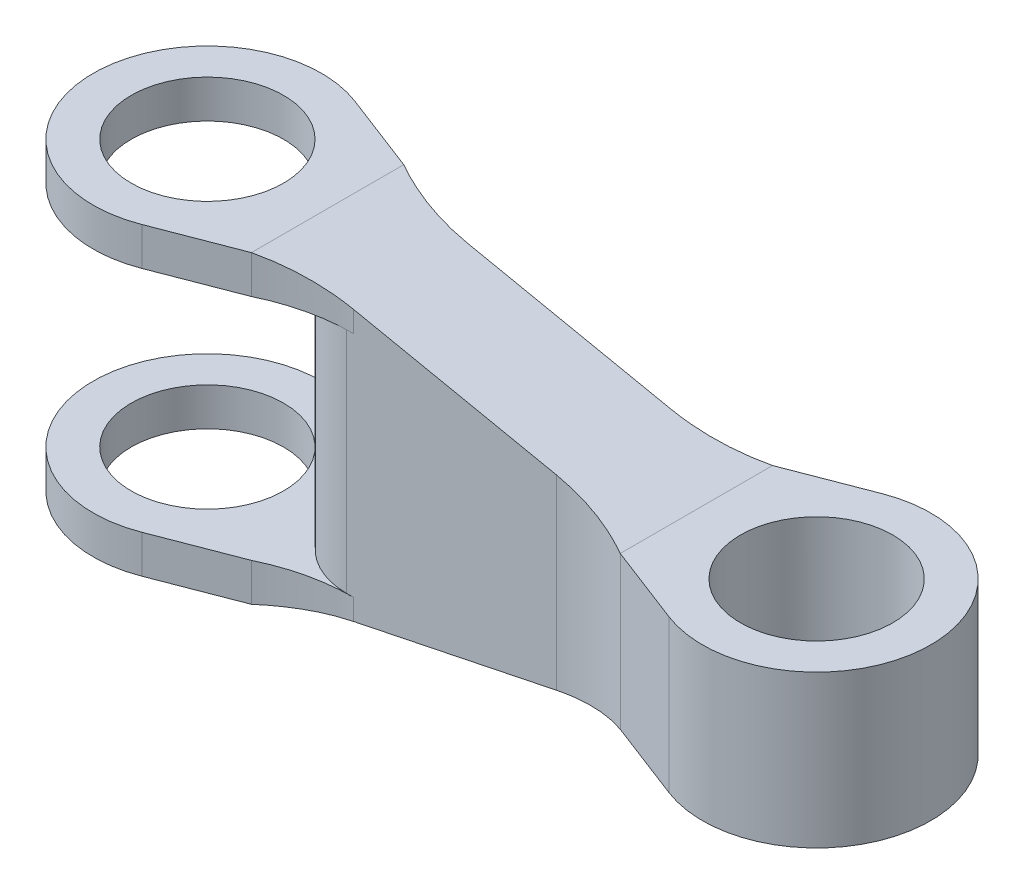
ISO-10303-21;
HEADER;
FILE_DESCRIPTION(('STEP AP214'),'2;1');
FILE_NAME('part.step','',(''),(''),'','','');
FILE_SCHEMA(('AUTOMOTIVE_DESIGN { 1 0 10303 214 1 1 1 1 }'));
ENDSEC;
DATA;
#1=APPLICATION_CONTEXT('core data for automotive mechanical design processes');
#2=APPLICATION_PROTOCOL_DEFINITION('international standard','automotive_design',2000,#1);
#3=PRODUCT_CONTEXT('',#1,'mechanical');
#4=PRODUCT('Part','Part','',(#3));
#5=PRODUCT_RELATED_PRODUCT_CATEGORY('part','',(#4));
#6=PRODUCT_DEFINITION_FORMATION('','',#4);
#7=PRODUCT_DEFINITION_CONTEXT('part definition',#1,'design');
#8=PRODUCT_DEFINITION('design','',#6,#7);
#9=PRODUCT_DEFINITION_SHAPE('','',#8);
#10=(LENGTH_UNIT() NAMED_UNIT(*) SI_UNIT(.MILLI.,.METRE.));
#11=(NAMED_UNIT(*) PLANE_ANGLE_UNIT() SI_UNIT($,.RADIAN.));
#12=(NAMED_UNIT(*) SI_UNIT($,.STERADIAN.) SOLID_ANGLE_UNIT());
#13=UNCERTAINTY_MEASURE_WITH_UNIT(LENGTH_MEASURE(1.E-05),#10,'distance_accuracy_value','');
#14=(GEOMETRIC_REPRESENTATION_CONTEXT(3) GLOBAL_UNCERTAINTY_ASSIGNED_CONTEXT((#13)) GLOBAL_UNIT_ASSIGNED_CONTEXT((#10,
#11,#12)) REPRESENTATION_CONTEXT('',''));
#15=CARTESIAN_POINT('',(0.,0.,0.));
#16=DIRECTION('',(0.,0.,1.));
#17=DIRECTION('',(1.,0.,0.));
#18=AXIS2_PLACEMENT_3D('',#15,#16,#17);
#19=CARTESIAN_POINT('',(0.,10.16,0.));
#20=DIRECTION('',(0.,-1.,0.));
#21=DIRECTION('',(0.,0.,-1.));
#22=AXIS2_PLACEMENT_3D('',#19,#20,#21);
#23=CYLINDRICAL_SURFACE('',#22,7.62);
#24=CARTESIAN_POINT('',(0.,-7.62,0.));
#25=DIRECTION('',(0.,-1.,0.));
#26=DIRECTION('',(0.,0.,-1.));
#27=AXIS2_PLACEMENT_3D('',#24,#25,#26);
#28=CIRCLE('',#27,7.62);
#29=CARTESIAN_POINT('',(2.73566372202433,-7.62,7.112));
#30=VERTEX_POINT('',#29);
#31=CARTESIAN_POINT('',(2.73566372202433,-7.62,-7.112));
#32=VERTEX_POINT('',#31);
#33=EDGE_CURVE('E327',#30,#32,#28,.T.);
#34=ORIENTED_EDGE('',*,*,#33,.T.);
#35=DIRECTION('',(0.,-1.,0.));
#36=VECTOR('',#35,1.);
#37=CARTESIAN_POINT('',(2.73566372202433,10.16,-7.112));
#38=LINE('',#37,#36);
#39=CARTESIAN_POINT('',(2.73566372202433,-10.16,-7.112));
#40=VERTEX_POINT('',#39);
#41=EDGE_CURVE('E370',#32,#40,#38,.T.);
#42=ORIENTED_EDGE('',*,*,#41,.T.);
#43=CARTESIAN_POINT('',(0.,-10.16,0.));
#44=DIRECTION('',(0.,1.,0.));
#45=DIRECTION('',(0.,0.,1.));
#46=AXIS2_PLACEMENT_3D('',#43,#44,#45);
#47=CIRCLE('',#46,7.62);
#48=CARTESIAN_POINT('',(2.73566372202433,-10.16,7.112));
#49=VERTEX_POINT('',#48);
#50=EDGE_CURVE('E358',#40,#49,#47,.T.);
#51=ORIENTED_EDGE('',*,*,#50,.T.);
#52=DIRECTION('',(0.,-1.,0.));
#53=VECTOR('',#52,1.);
#54=CARTESIAN_POINT('',(2.73566372202433,10.16,7.112));
#55=LINE('',#54,#53);
#56=EDGE_CURVE('E219',#30,#49,#55,.T.);
#57=ORIENTED_EDGE('',*,*,#56,.F.);
#58=EDGE_LOOP('',(#34,#42,#51,#57));
#59=FACE_BOUND('',#58,.T.);
#60=ADVANCED_FACE('F35',(#59),#23,.T.);
#61=CARTESIAN_POINT('',(2.73566372202433,10.16,7.112));
#62=DIRECTION('',(-0.359010987142301,0.,-0.933333333333333));
#63=DIRECTION('',(-0.933333333333333,0.,0.359010987142301));
#64=AXIS2_PLACEMENT_3D('',#61,#62,#63);
#65=PLANE('',#64);
#66=CARTESIAN_POINT('',(2.73566372202433,10.16,7.112));
#67=VERTEX_POINT('',#66);
#68=CARTESIAN_POINT('',(2.73566372202433,7.62,7.112));
#69=VERTEX_POINT('',#68);
#70=EDGE_CURVE('E220',#67,#69,#55,.T.);
#71=ORIENTED_EDGE('',*,*,#70,.T.);
#72=DIRECTION('',(0.933333333333333,0.,-0.359010987142301));
#73=VECTOR('',#72,1.);
#74=CARTESIAN_POINT('',(2.73566372202433,7.62,7.112));
#75=LINE('',#74,#73);
#76=CARTESIAN_POINT('',(8.01832470248509,7.62,5.08));
#77=VERTEX_POINT('',#76);
#78=EDGE_CURVE('E336',#69,#77,#75,.T.);
#79=ORIENTED_EDGE('',*,*,#78,.T.);
#80=DIRECTION('',(0.,-1.,0.));
#81=VECTOR('',#80,1.);
#82=CARTESIAN_POINT('',(8.01832470248509,10.16,5.08));
#83=LINE('',#82,#81);
#84=CARTESIAN_POINT('',(8.01832470248509,10.16,5.08));
#85=VERTEX_POINT('',#84);
#86=EDGE_CURVE('E216',#85,#77,#83,.T.);
#87=ORIENTED_EDGE('',*,*,#86,.F.);
#88=DIRECTION('',(0.933333333333333,0.,-0.359010987142301));
#89=VECTOR('',#88,1.);
#90=CARTESIAN_POINT('',(2.73566372202433,10.16,7.112));
#91=LINE('',#90,#89);
#92=EDGE_CURVE('E364',#67,#85,#91,.T.);
#93=ORIENTED_EDGE('',*,*,#92,.F.);
#94=EDGE_LOOP('',(#71,#79,#87,#93));
#95=FACE_BOUND('',#94,.T.);
#96=ADVANCED_FACE('F439',(#95),#65,.F.);
#97=CARTESIAN_POINT('',(2.73566372202433,10.16,-7.112));
#98=DIRECTION('',(-0.359010987142301,0.,0.933333333333333));
#99=DIRECTION('',(0.933333333333333,0.,0.359010987142301));
#100=AXIS2_PLACEMENT_3D('',#97,#98,#99);
#101=PLANE('',#100);
#102=DIRECTION('',(0.,-1.,0.));
#103=VECTOR('',#102,1.);
#104=CARTESIAN_POINT('',(8.01832470248509,10.16,-5.08));
#105=LINE('',#104,#103);
#106=CARTESIAN_POINT('',(8.01832470248509,10.16,-5.08));
#107=VERTEX_POINT('',#106);
#108=CARTESIAN_POINT('',(8.01832470248509,7.62,-5.08));
#109=VERTEX_POINT('',#108);
#110=EDGE_CURVE('E209',#107,#109,#105,.T.);
#111=ORIENTED_EDGE('',*,*,#110,.T.);
#112=DIRECTION('',(-0.933333333333333,0.,-0.359010987142301));
#113=VECTOR('',#112,1.);
#114=CARTESIAN_POINT('',(2.73566372202433,7.62,-7.112));
#115=LINE('',#114,#113);
#116=CARTESIAN_POINT('',(2.73566372202433,7.62,-7.112));
#117=VERTEX_POINT('',#116);
#118=EDGE_CURVE('E236',#109,#117,#115,.T.);
#119=ORIENTED_EDGE('',*,*,#118,.T.);
#120=CARTESIAN_POINT('',(2.73566372202433,10.16,-7.112));
#121=VERTEX_POINT('',#120);
#122=EDGE_CURVE('E378',#121,#117,#38,.T.);
#123=ORIENTED_EDGE('',*,*,#122,.F.);
#124=DIRECTION('',(-0.933333333333333,0.,-0.359010987142301));
#125=VECTOR('',#124,1.);
#126=CARTESIAN_POINT('',(2.73566372202433,10.16,-7.112));
#127=LINE('',#126,#125);
#128=EDGE_CURVE('E368',#107,#121,#127,.T.);
#129=ORIENTED_EDGE('',*,*,#128,.F.);
#130=EDGE_LOOP('',(#111,#119,#123,#129));
#131=FACE_BOUND('',#130,.T.);
#132=ADVANCED_FACE('F451',(#131),#101,.F.);
#133=CARTESIAN_POINT('',(0.,10.16,0.));
#134=DIRECTION('',(0.,-1.,0.));
#135=DIRECTION('',(0.,0.,-1.));
#136=AXIS2_PLACEMENT_3D('',#133,#134,#135);
#137=CYLINDRICAL_SURFACE('',#136,5.08);
#138=CARTESIAN_POINT('',(0.,7.62,0.));
#139=DIRECTION('',(0.,1.,0.));
#140=DIRECTION('',(0.,0.,1.));
#141=AXIS2_PLACEMENT_3D('',#138,#139,#140);
#142=CIRCLE('',#141,5.08);
#143=CARTESIAN_POINT('',(0.,7.62,5.08));
#144=VERTEX_POINT('',#143);
#145=EDGE_CURVE('E233',#144,#144,#142,.T.);
#146=ORIENTED_EDGE('',*,*,#145,.F.);
#147=EDGE_LOOP('',(#146));
#148=FACE_BOUND('',#147,.T.);
#149=CARTESIAN_POINT('',(0.,10.16,0.));
#150=DIRECTION('',(0.,1.,0.));
#151=DIRECTION('',(0.,0.,1.));
#152=AXIS2_PLACEMENT_3D('',#149,#150,#151);
#153=CIRCLE('',#152,5.08);
#154=CARTESIAN_POINT('',(0.,10.16,5.08));
#155=VERTEX_POINT('',#154);
#156=EDGE_CURVE('E355',#155,#155,#153,.T.);
#157=ORIENTED_EDGE('',*,*,#156,.T.);
#158=EDGE_LOOP('',(#157));
#159=FACE_BOUND('',#158,.T.);
#160=ADVANCED_FACE('F453',(#148,#159),#137,.F.);
#161=CARTESIAN_POINT('',(0.,10.16,0.));
#162=DIRECTION('',(0.,1.,0.));
#163=DIRECTION('',(0.,0.,1.));
#164=AXIS2_PLACEMENT_3D('',#161,#162,#163);
#165=PLANE('',#164);
#166=DIRECTION('',(0.,0.,1.));
#167=VECTOR('',#166,1.);
#168=CARTESIAN_POINT('',(8.01832470248509,10.16,-7.62));
#169=LINE('',#168,#167);
#170=EDGE_CURVE('E339',#107,#85,#169,.T.);
#171=ORIENTED_EDGE('',*,*,#170,.F.);
#172=ORIENTED_EDGE('',*,*,#128,.T.);
#173=CARTESIAN_POINT('',(0.,10.16,0.));
#174=DIRECTION('',(0.,1.,0.));
#175=DIRECTION('',(0.,0.,1.));
#176=AXIS2_PLACEMENT_3D('',#173,#174,#175);
#177=CIRCLE('',#176,7.62);
#178=EDGE_CURVE('E361',#121,#67,#177,.T.);
#179=ORIENTED_EDGE('',*,*,#178,.T.);
#180=ORIENTED_EDGE('',*,*,#92,.T.);
#181=EDGE_LOOP('',(#171,#172,#179,#180));
#182=FACE_BOUND('',#181,.T.);
#183=ORIENTED_EDGE('',*,*,#156,.F.);
#184=EDGE_LOOP('',(#183));
#185=FACE_BOUND('',#184,.T.);
#186=ADVANCED_FACE('F444',(#182,#185),#165,.T.);
#187=CARTESIAN_POINT('',(0.,-10.16,0.));
#188=DIRECTION('',(0.,1.,0.));
#189=DIRECTION('',(0.,0.,1.));
#190=AXIS2_PLACEMENT_3D('',#187,#188,#189);
#191=PLANE('',#190);
#192=CARTESIAN_POINT('',(0.,-10.16,0.));
#193=DIRECTION('',(0.,1.,0.));
#194=DIRECTION('',(0.,0.,1.));
#195=AXIS2_PLACEMENT_3D('',#192,#193,#194);
#196=CIRCLE('',#195,5.08);
#197=CARTESIAN_POINT('',(0.,-10.16,5.08));
#198=VERTEX_POINT('',#197);
#199=EDGE_CURVE('E354',#198,#198,#196,.T.);
#200=ORIENTED_EDGE('',*,*,#199,.T.);
#201=EDGE_LOOP('',(#200));
#202=FACE_BOUND('',#201,.T.);
#203=DIRECTION('',(-0.933333333333333,0.,-0.359010987142301));
#204=VECTOR('',#203,1.);
#205=CARTESIAN_POINT('',(2.73566372202433,-10.16,-7.112));
#206=LINE('',#205,#204);
#207=CARTESIAN_POINT('',(8.01832470248509,-10.16,-5.08));
#208=VERTEX_POINT('',#207);
#209=EDGE_CURVE('E365',#208,#40,#206,.T.);
#210=ORIENTED_EDGE('',*,*,#209,.F.);
#211=DIRECTION('',(0.,0.,1.));
#212=VECTOR('',#211,1.);
#213=CARTESIAN_POINT('',(8.01832470248509,-10.16,-7.62));
#214=LINE('',#213,#212);
#215=CARTESIAN_POINT('',(8.01832470248509,-10.16,5.08));
#216=VERTEX_POINT('',#215);
#217=EDGE_CURVE('E240',#208,#216,#214,.T.);
#218=ORIENTED_EDGE('',*,*,#217,.T.);
#219=DIRECTION('',(0.933333333333333,0.,-0.359010987142301));
#220=VECTOR('',#219,1.);
#221=CARTESIAN_POINT('',(2.73566372202433,-10.16,7.112));
#222=LINE('',#221,#220);
#223=EDGE_CURVE('E373',#49,#216,#222,.T.);
#224=ORIENTED_EDGE('',*,*,#223,.F.);
#225=ORIENTED_EDGE('',*,*,#50,.F.);
#226=EDGE_LOOP('',(#210,#218,#224,#225));
#227=FACE_BOUND('',#226,.T.);
#228=ADVANCED_FACE('F396',(#202,#227),#191,.F.);
#229=ORIENTED_EDGE('',*,*,#122,.T.);
#230=CARTESIAN_POINT('',(0.,7.62,0.));
#231=DIRECTION('',(0.,1.,0.));
#232=DIRECTION('',(0.,0.,1.));
#233=AXIS2_PLACEMENT_3D('',#230,#231,#232);
#234=CIRCLE('',#233,7.62);
#235=EDGE_CURVE('E333',#117,#69,#234,.T.);
#236=ORIENTED_EDGE('',*,*,#235,.T.);
#237=ORIENTED_EDGE('',*,*,#70,.F.);
#238=ORIENTED_EDGE('',*,*,#178,.F.);
#239=EDGE_LOOP('',(#229,#236,#237,#238));
#240=FACE_BOUND('',#239,.T.);
#241=ADVANCED_FACE('F449',(#240),#23,.T.);
#242=CARTESIAN_POINT('',(8.01832470248509,-7.62,5.08));
#243=VERTEX_POINT('',#242);
#244=EDGE_CURVE('E215',#243,#216,#83,.T.);
#245=ORIENTED_EDGE('',*,*,#244,.F.);
#246=DIRECTION('',(-0.933333333333333,0.,0.359010987142301));
#247=VECTOR('',#246,1.);
#248=CARTESIAN_POINT('',(2.73566372202433,-7.62,7.112));
#249=LINE('',#248,#247);
#250=EDGE_CURVE('E237',#243,#30,#249,.T.);
#251=ORIENTED_EDGE('',*,*,#250,.T.);
#252=ORIENTED_EDGE('',*,*,#56,.T.);
#253=ORIENTED_EDGE('',*,*,#223,.T.);
#254=EDGE_LOOP('',(#245,#251,#252,#253));
#255=FACE_BOUND('',#254,.T.);
#256=ADVANCED_FACE('F431',(#255),#65,.F.);
#257=CARTESIAN_POINT('',(8.01832470248509,10.16,3.81));
#258=DIRECTION('',(0.,0.,-1.));
#259=DIRECTION('',(-1.,0.,0.));
#260=AXIS2_PLACEMENT_3D('',#257,#258,#259);
#261=PLANE('',#260);
#262=DIRECTION('',(-1.,0.,0.));
#263=VECTOR('',#262,1.);
#264=CARTESIAN_POINT('',(-7.62,7.62,3.81));
#265=LINE('',#264,#263);
#266=CARTESIAN_POINT('',(13.5541263607817,7.62,3.81));
#267=VERTEX_POINT('',#266);
#268=CARTESIAN_POINT('',(13.0983247024851,7.62,3.81));
#269=VERTEX_POINT('',#268);
#270=EDGE_CURVE('E223',#267,#269,#265,.T.);
#271=ORIENTED_EDGE('',*,*,#270,.T.);
#272=DIRECTION('',(0.,-1.,0.));
#273=VECTOR('',#272,1.);
#274=CARTESIAN_POINT('',(13.0983247024851,10.16,3.81));
#275=LINE('',#274,#273);
#276=CARTESIAN_POINT('',(13.0983247024851,-7.62,3.81));
#277=VERTEX_POINT('',#276);
#278=EDGE_CURVE('E298',#269,#277,#275,.T.);
#279=ORIENTED_EDGE('',*,*,#278,.T.);
#280=DIRECTION('',(1.,0.,0.));
#281=VECTOR('',#280,1.);
#282=CARTESIAN_POINT('',(-7.62,-7.62,3.81));
#283=LINE('',#282,#281);
#284=CARTESIAN_POINT('',(13.5541263607817,-7.62,3.81));
#285=VERTEX_POINT('',#284);
#286=EDGE_CURVE('E246',#277,#285,#283,.T.);
#287=ORIENTED_EDGE('',*,*,#286,.T.);
#288=DIRECTION('',(0.,-1.,0.));
#289=VECTOR('',#288,1.);
#290=CARTESIAN_POINT('',(13.5541263607817,10.16,3.81));
#291=LINE('',#290,#289);
#292=CARTESIAN_POINT('',(13.5541263607817,-9.01699013573265,3.81));
#293=VERTEX_POINT('',#292);
#294=EDGE_CURVE('E248',#285,#293,#291,.T.);
#295=ORIENTED_EDGE('',*,*,#294,.T.);
#296=DIRECTION('',(0.979342066351469,0.202210576069687,0.));
#297=VECTOR('',#296,1.);
#298=CARTESIAN_POINT('',(12.0423618340992,-9.32913314104749,3.81));
#299=LINE('',#298,#297);
#300=CARTESIAN_POINT('',(27.0858736392183,-6.22300986426735,3.81));
#301=VERTEX_POINT('',#300);
#302=EDGE_CURVE('E232',#293,#301,#299,.T.);
#303=ORIENTED_EDGE('',*,*,#302,.T.);
#304=DIRECTION('',(0.,1.,0.));
#305=VECTOR('',#304,1.);
#306=CARTESIAN_POINT('',(27.0858736392183,10.16,3.81));
#307=LINE('',#306,#305);
#308=CARTESIAN_POINT('',(27.0858736392183,6.22300986426735,3.81));
#309=VERTEX_POINT('',#308);
#310=EDGE_CURVE('E251',#301,#309,#307,.T.);
#311=ORIENTED_EDGE('',*,*,#310,.T.);
#312=DIRECTION('',(-0.979342066351469,0.202210576069687,0.));
#313=VECTOR('',#312,1.);
#314=CARTESIAN_POINT('',(8.01832470248509,10.16,3.81));
#315=LINE('',#314,#313);
#316=CARTESIAN_POINT('',(13.5541263607817,9.01699013573265,3.81));
#317=VERTEX_POINT('',#316);
#318=EDGE_CURVE('E351',#309,#317,#315,.T.);
#319=ORIENTED_EDGE('',*,*,#318,.T.);
#320=DIRECTION('',(0.,-1.,0.));
#321=VECTOR('',#320,1.);
#322=CARTESIAN_POINT('',(13.5541263607817,10.16,3.81));
#323=LINE('',#322,#321);
#324=EDGE_CURVE('E243',#317,#267,#323,.T.);
#325=ORIENTED_EDGE('',*,*,#324,.T.);
#326=EDGE_LOOP('',(#271,#279,#287,#295,#303,#311,#319,#325));
#327=FACE_BOUND('',#326,.T.);
#328=ADVANCED_FACE('F423',(#327),#261,.F.);
#329=CARTESIAN_POINT('',(32.6216752975149,10.16,5.08));
#330=DIRECTION('',(0.359010987142301,0.,-0.933333333333333));
#331=DIRECTION('',(-0.933333333333333,0.,-0.359010987142301));
#332=AXIS2_PLACEMENT_3D('',#329,#330,#331);
#333=PLANE('',#332);
#334=DIRECTION('',(0.,-1.,0.));
#335=VECTOR('',#334,1.);
#336=CARTESIAN_POINT('',(32.6216752975149,10.16,5.08));
#337=LINE('',#336,#335);
#338=CARTESIAN_POINT('',(32.6216752975149,5.08,5.08));
#339=VERTEX_POINT('',#338);
#340=CARTESIAN_POINT('',(32.6216752975149,-5.08,5.08));
#341=VERTEX_POINT('',#340);
#342=EDGE_CURVE('E206',#339,#341,#337,.T.);
#343=ORIENTED_EDGE('',*,*,#342,.T.);
#344=DIRECTION('',(0.933333333333333,0.,0.359010987142301));
#345=VECTOR('',#344,1.);
#346=CARTESIAN_POINT('',(32.6216752975149,-5.08,5.08));
#347=LINE('',#346,#345);
#348=CARTESIAN_POINT('',(37.9043362779757,-5.08,7.112));
#349=VERTEX_POINT('',#348);
#350=EDGE_CURVE('E189',#341,#349,#347,.T.);
#351=ORIENTED_EDGE('',*,*,#350,.T.);
#352=DIRECTION('',(0.,-1.,0.));
#353=VECTOR('',#352,1.);
#354=CARTESIAN_POINT('',(37.9043362779757,10.16,7.112));
#355=LINE('',#354,#353);
#356=CARTESIAN_POINT('',(37.9043362779757,5.08,7.112));
#357=VERTEX_POINT('',#356);
#358=EDGE_CURVE('E185',#357,#349,#355,.T.);
#359=ORIENTED_EDGE('',*,*,#358,.F.);
#360=DIRECTION('',(-0.933333333333333,0.,-0.359010987142301));
#361=VECTOR('',#360,1.);
#362=CARTESIAN_POINT('',(32.6216752975149,5.08,5.08));
#363=LINE('',#362,#361);
#364=EDGE_CURVE('E345',#357,#339,#363,.T.);
#365=ORIENTED_EDGE('',*,*,#364,.T.);
#366=EDGE_LOOP('',(#343,#351,#359,#365));
#367=FACE_BOUND('',#366,.T.);
#368=ADVANCED_FACE('F417',(#367),#333,.F.);
#369=CARTESIAN_POINT('',(40.64,10.16,0.));
#370=DIRECTION('',(0.,-1.,0.));
#371=DIRECTION('',(0.,0.,-1.));
#372=AXIS2_PLACEMENT_3D('',#369,#370,#371);
#373=CYLINDRICAL_SURFACE('',#372,7.62);
#374=CARTESIAN_POINT('',(40.64,-5.08,0.));
#375=DIRECTION('',(0.,1.,0.));
#376=DIRECTION('',(0.,0.,1.));
#377=AXIS2_PLACEMENT_3D('',#374,#375,#376);
#378=CIRCLE('',#377,7.62);
#379=CARTESIAN_POINT('',(37.9043362779757,-5.08,-7.112));
#380=VERTEX_POINT('',#379);
#381=EDGE_CURVE('E178',#349,#380,#378,.T.);
#382=ORIENTED_EDGE('',*,*,#381,.T.);
#383=DIRECTION('',(0.,-1.,0.));
#384=VECTOR('',#383,1.);
#385=CARTESIAN_POINT('',(37.9043362779757,10.16,-7.112));
#386=LINE('',#385,#384);
#387=CARTESIAN_POINT('',(37.9043362779757,5.08,-7.112));
#388=VERTEX_POINT('',#387);
#389=EDGE_CURVE('E183',#388,#380,#386,.T.);
#390=ORIENTED_EDGE('',*,*,#389,.F.);
#391=CARTESIAN_POINT('',(40.64,5.08,0.));
#392=DIRECTION('',(0.,-1.,0.));
#393=DIRECTION('',(0.,0.,-1.));
#394=AXIS2_PLACEMENT_3D('',#391,#392,#393);
#395=CIRCLE('',#394,7.62);
#396=EDGE_CURVE('E343',#388,#357,#395,.T.);
#397=ORIENTED_EDGE('',*,*,#396,.T.);
#398=ORIENTED_EDGE('',*,*,#358,.T.);
#399=EDGE_LOOP('',(#382,#390,#397,#398));
#400=FACE_BOUND('',#399,.T.);
#401=ADVANCED_FACE('F180',(#400),#373,.T.);
#402=CARTESIAN_POINT('',(32.6216752975149,10.16,-5.08));
#403=DIRECTION('',(0.359010987142301,0.,0.933333333333333));
#404=DIRECTION('',(0.933333333333333,0.,-0.359010987142301));
#405=AXIS2_PLACEMENT_3D('',#402,#403,#404);
#406=PLANE('',#405);
#407=ORIENTED_EDGE('',*,*,#389,.T.);
#408=DIRECTION('',(-0.933333333333333,0.,0.359010987142301));
#409=VECTOR('',#408,1.);
#410=CARTESIAN_POINT('',(32.6216752975149,-5.08,-5.08));
#411=LINE('',#410,#409);
#412=CARTESIAN_POINT('',(32.6216752975149,-5.08,-5.08));
#413=VERTEX_POINT('',#412);
#414=EDGE_CURVE('E190',#380,#413,#411,.T.);
#415=ORIENTED_EDGE('',*,*,#414,.T.);
#416=DIRECTION('',(0.,-1.,0.));
#417=VECTOR('',#416,1.);
#418=CARTESIAN_POINT('',(32.6216752975149,10.16,-5.08));
#419=LINE('',#418,#417);
#420=CARTESIAN_POINT('',(32.6216752975149,5.08,-5.08));
#421=VERTEX_POINT('',#420);
#422=EDGE_CURVE('E204',#421,#413,#419,.T.);
#423=ORIENTED_EDGE('',*,*,#422,.F.);
#424=DIRECTION('',(0.933333333333333,0.,-0.359010987142301));
#425=VECTOR('',#424,1.);
#426=CARTESIAN_POINT('',(32.6216752975149,5.08,-5.08));
#427=LINE('',#426,#425);
#428=EDGE_CURVE('E203',#421,#388,#427,.T.);
#429=ORIENTED_EDGE('',*,*,#428,.T.);
#430=EDGE_LOOP('',(#407,#415,#423,#429));
#431=FACE_BOUND('',#430,.T.);
#432=ADVANCED_FACE('F201',(#431),#406,.F.);
#433=CARTESIAN_POINT('',(8.01832470248509,10.16,-3.81));
#434=DIRECTION('',(0.,0.,1.));
#435=DIRECTION('',(1.,0.,0.));
#436=AXIS2_PLACEMENT_3D('',#433,#434,#435);
#437=PLANE('',#436);
#438=DIRECTION('',(-1.,0.,0.));
#439=VECTOR('',#438,1.);
#440=CARTESIAN_POINT('',(-7.62,-7.62,-3.81));
#441=LINE('',#440,#439);
#442=CARTESIAN_POINT('',(13.5541263607817,-7.62,-3.81));
#443=VERTEX_POINT('',#442);
#444=CARTESIAN_POINT('',(13.0983247024851,-7.62,-3.81));
#445=VERTEX_POINT('',#444);
#446=EDGE_CURVE('E257',#443,#445,#441,.T.);
#447=ORIENTED_EDGE('',*,*,#446,.T.);
#448=DIRECTION('',(0.,1.,0.));
#449=VECTOR('',#448,1.);
#450=CARTESIAN_POINT('',(13.0983247024851,10.16,-3.81));
#451=LINE('',#450,#449);
#452=CARTESIAN_POINT('',(13.0983247024851,7.62,-3.81));
#453=VERTEX_POINT('',#452);
#454=EDGE_CURVE('E295',#445,#453,#451,.T.);
#455=ORIENTED_EDGE('',*,*,#454,.T.);
#456=DIRECTION('',(1.,0.,0.));
#457=VECTOR('',#456,1.);
#458=CARTESIAN_POINT('',(-7.62,7.62,-3.81));
#459=LINE('',#458,#457);
#460=CARTESIAN_POINT('',(13.5541263607817,7.62,-3.81));
#461=VERTEX_POINT('',#460);
#462=EDGE_CURVE('E255',#453,#461,#459,.T.);
#463=ORIENTED_EDGE('',*,*,#462,.T.);
#464=DIRECTION('',(0.,1.,0.));
#465=VECTOR('',#464,1.);
#466=CARTESIAN_POINT('',(13.5541263607817,10.16,-3.81));
#467=LINE('',#466,#465);
#468=CARTESIAN_POINT('',(13.5541263607817,9.01699013573265,-3.81));
#469=VERTEX_POINT('',#468);
#470=EDGE_CURVE('E253',#461,#469,#467,.T.);
#471=ORIENTED_EDGE('',*,*,#470,.T.);
#472=DIRECTION('',(0.979342066351469,-0.202210576069687,0.));
#473=VECTOR('',#472,1.);
#474=CARTESIAN_POINT('',(8.01832470248509,10.16,-3.81));
#475=LINE('',#474,#473);
#476=CARTESIAN_POINT('',(27.0858736392183,6.22300986426735,-3.81));
#477=VERTEX_POINT('',#476);
#478=EDGE_CURVE('E348',#469,#477,#475,.T.);
#479=ORIENTED_EDGE('',*,*,#478,.T.);
#480=DIRECTION('',(0.,-1.,0.));
#481=VECTOR('',#480,1.);
#482=CARTESIAN_POINT('',(27.0858736392183,10.16,-3.81));
#483=LINE('',#482,#481);
#484=CARTESIAN_POINT('',(27.0858736392183,-6.22300986426735,-3.81));
#485=VERTEX_POINT('',#484);
#486=EDGE_CURVE('E263',#477,#485,#483,.T.);
#487=ORIENTED_EDGE('',*,*,#486,.T.);
#488=DIRECTION('',(-0.979342066351469,-0.202210576069687,0.));
#489=VECTOR('',#488,1.);
#490=CARTESIAN_POINT('',(12.0423618340992,-9.32913314104749,-3.81));
#491=LINE('',#490,#489);
#492=CARTESIAN_POINT('',(13.5541263607817,-9.01699013573265,-3.81));
#493=VERTEX_POINT('',#492);
#494=EDGE_CURVE('E321',#485,#493,#491,.T.);
#495=ORIENTED_EDGE('',*,*,#494,.T.);
#496=DIRECTION('',(0.,1.,0.));
#497=VECTOR('',#496,1.);
#498=CARTESIAN_POINT('',(13.5541263607817,10.16,-3.81));
#499=LINE('',#498,#497);
#500=EDGE_CURVE('E260',#493,#443,#499,.T.);
#501=ORIENTED_EDGE('',*,*,#500,.T.);
#502=EDGE_LOOP('',(#447,#455,#463,#471,#479,#487,#495,#501));
#503=FACE_BOUND('',#502,.T.);
#504=ADVANCED_FACE('F309',(#503),#437,.F.);
#505=ORIENTED_EDGE('',*,*,#41,.F.);
#506=DIRECTION('',(0.933333333333333,0.,0.359010987142301));
#507=VECTOR('',#506,1.);
#508=CARTESIAN_POINT('',(2.73566372202433,-7.62,-7.112));
#509=LINE('',#508,#507);
#510=CARTESIAN_POINT('',(8.01832470248509,-7.62,-5.08));
#511=VERTEX_POINT('',#510);
#512=EDGE_CURVE('E231',#32,#511,#509,.T.);
#513=ORIENTED_EDGE('',*,*,#512,.T.);
#514=EDGE_CURVE('E380',#511,#208,#105,.T.);
#515=ORIENTED_EDGE('',*,*,#514,.T.);
#516=ORIENTED_EDGE('',*,*,#209,.T.);
#517=EDGE_LOOP('',(#505,#513,#515,#516));
#518=FACE_BOUND('',#517,.T.);
#519=ADVANCED_FACE('F390',(#518),#101,.F.);
#520=CARTESIAN_POINT('',(0.,-7.62,0.));
#521=DIRECTION('',(0.,-1.,0.));
#522=DIRECTION('',(0.,0.,-1.));
#523=AXIS2_PLACEMENT_3D('',#520,#521,#522);
#524=CIRCLE('',#523,5.08);
#525=CARTESIAN_POINT('',(0.,-7.62,-5.08));
#526=VERTEX_POINT('',#525);
#527=EDGE_CURVE('E228',#526,#526,#524,.T.);
#528=ORIENTED_EDGE('',*,*,#527,.F.);
#529=EDGE_LOOP('',(#528));
#530=FACE_BOUND('',#529,.T.);
#531=ORIENTED_EDGE('',*,*,#199,.F.);
#532=EDGE_LOOP('',(#531));
#533=FACE_BOUND('',#532,.T.);
#534=ADVANCED_FACE('F461',(#530,#533),#137,.F.);
#535=CARTESIAN_POINT('',(40.64,10.16,0.));
#536=DIRECTION('',(0.,-1.,0.));
#537=DIRECTION('',(0.,0.,-1.));
#538=AXIS2_PLACEMENT_3D('',#535,#536,#537);
#539=CYLINDRICAL_SURFACE('',#538,5.08);
#540=CARTESIAN_POINT('',(40.64,-5.08,0.));
#541=DIRECTION('',(0.,1.,0.));
#542=DIRECTION('',(0.,0.,1.));
#543=AXIS2_PLACEMENT_3D('',#540,#541,#542);
#544=CIRCLE('',#543,5.08);
#545=CARTESIAN_POINT('',(40.64,-5.08,5.08));
#546=VERTEX_POINT('',#545);
#547=EDGE_CURVE('E198',#546,#546,#544,.T.);
#548=ORIENTED_EDGE('',*,*,#547,.F.);
#549=EDGE_LOOP('',(#548));
#550=FACE_BOUND('',#549,.T.);
#551=CARTESIAN_POINT('',(40.64,5.08,0.));
#552=DIRECTION('',(0.,-1.,0.));
#553=DIRECTION('',(0.,0.,-1.));
#554=AXIS2_PLACEMENT_3D('',#551,#552,#553);
#555=CIRCLE('',#554,5.08);
#556=CARTESIAN_POINT('',(40.64,5.08,-5.08));
#557=VERTEX_POINT('',#556);
#558=EDGE_CURVE('E224',#557,#557,#555,.T.);
#559=ORIENTED_EDGE('',*,*,#558,.F.);
#560=EDGE_LOOP('',(#559));
#561=FACE_BOUND('',#560,.T.);
#562=ADVANCED_FACE('F483',(#550,#561),#539,.F.);
#563=CARTESIAN_POINT('',(8.01832470248509,10.16,-7.62));
#564=DIRECTION('',(-0.202210576069687,-0.979342066351469,0.));
#565=DIRECTION('',(0.979342066351469,-0.202210576069687,0.));
#566=AXIS2_PLACEMENT_3D('',#563,#564,#565);
#567=PLANE('',#566);
#568=DIRECTION('',(0.,0.,1.));
#569=VECTOR('',#568,1.);
#570=CARTESIAN_POINT('',(32.6216752975149,5.08,-7.62));
#571=LINE('',#570,#569);
#572=EDGE_CURVE('E227',#421,#339,#571,.T.);
#573=ORIENTED_EDGE('',*,*,#572,.F.);
#574=CARTESIAN_POINT('',(27.0858736392183,6.22300986426735,-16.51));
#575=DIRECTION('',(-0.202210576069687,-0.979342066351469,0.));
#576=DIRECTION('',(0.979342066351469,-0.202210576069687,0.));
#577=AXIS2_PLACEMENT_3D('',#574,#575,#576);
#578=ELLIPSE('',#577,12.9678898071986,12.7);
#579=EDGE_CURVE('E273',#421,#477,#578,.T.);
#580=ORIENTED_EDGE('',*,*,#579,.T.);
#581=ORIENTED_EDGE('',*,*,#478,.F.);
#582=CARTESIAN_POINT('',(13.5541263607817,9.01699013573265,-16.51));
#583=DIRECTION('',(-0.202210576069687,-0.979342066351469,0.));
#584=DIRECTION('',(-0.979342066351469,0.202210576069687,0.));
#585=AXIS2_PLACEMENT_3D('',#582,#583,#584);
#586=ELLIPSE('',#585,12.9678898071986,12.7);
#587=EDGE_CURVE('E282',#469,#107,#586,.T.);
#588=ORIENTED_EDGE('',*,*,#587,.T.);
#589=ORIENTED_EDGE('',*,*,#170,.T.);
#590=CARTESIAN_POINT('',(13.5541263607817,9.01699013573265,16.51));
#591=DIRECTION('',(-0.202210576069687,-0.979342066351469,0.));
#592=DIRECTION('',(0.979342066351469,-0.202210576069687,0.));
#593=AXIS2_PLACEMENT_3D('',#590,#591,#592);
#594=ELLIPSE('',#593,12.9678898071986,12.7);
#595=EDGE_CURVE('E293',#85,#317,#594,.T.);
#596=ORIENTED_EDGE('',*,*,#595,.T.);
#597=ORIENTED_EDGE('',*,*,#318,.F.);
#598=CARTESIAN_POINT('',(27.0858736392183,6.22300986426735,16.51));
#599=DIRECTION('',(-0.202210576069687,-0.979342066351469,0.));
#600=DIRECTION('',(-0.979342066351469,0.202210576069687,0.));
#601=AXIS2_PLACEMENT_3D('',#598,#599,#600);
#602=ELLIPSE('',#601,12.9678898071986,12.7);
#603=EDGE_CURVE('E268',#309,#339,#602,.T.);
#604=ORIENTED_EDGE('',*,*,#603,.T.);
#605=EDGE_LOOP('',(#573,#580,#581,#588,#589,#596,#597,#604));
#606=FACE_BOUND('',#605,.T.);
#607=ADVANCED_FACE('F409',(#606),#567,.F.);
#608=CARTESIAN_POINT('',(32.6216752975149,5.08,-7.62));
#609=DIRECTION('',(0.,-1.,0.));
#610=DIRECTION('',(0.,0.,-1.));
#611=AXIS2_PLACEMENT_3D('',#608,#609,#610);
#612=PLANE('',#611);
#613=ORIENTED_EDGE('',*,*,#558,.T.);
#614=EDGE_LOOP('',(#613));
#615=FACE_BOUND('',#614,.T.);
#616=ORIENTED_EDGE('',*,*,#396,.F.);
#617=ORIENTED_EDGE('',*,*,#428,.F.);
#618=ORIENTED_EDGE('',*,*,#572,.T.);
#619=ORIENTED_EDGE('',*,*,#364,.F.);
#620=EDGE_LOOP('',(#616,#617,#618,#619));
#621=FACE_BOUND('',#620,.T.);
#622=ADVANCED_FACE('F415',(#615,#621),#612,.F.);
#623=CARTESIAN_POINT('',(-7.62,7.62,-7.62));
#624=DIRECTION('',(0.,1.,0.));
#625=DIRECTION('',(0.,0.,1.));
#626=AXIS2_PLACEMENT_3D('',#623,#624,#625);
#627=PLANE('',#626);
#628=ORIENTED_EDGE('',*,*,#145,.T.);
#629=EDGE_LOOP('',(#628));
#630=FACE_BOUND('',#629,.T.);
#631=ORIENTED_EDGE('',*,*,#235,.F.);
#632=ORIENTED_EDGE('',*,*,#118,.F.);
#633=CARTESIAN_POINT('',(13.5541263607817,7.62,-16.51));
#634=DIRECTION('',(0.,1.,0.));
#635=DIRECTION('',(0.,0.,1.));
#636=AXIS2_PLACEMENT_3D('',#633,#634,#635);
#637=CIRCLE('',#636,12.7);
#638=EDGE_CURVE('E279',#109,#461,#637,.T.);
#639=ORIENTED_EDGE('',*,*,#638,.T.);
#640=ORIENTED_EDGE('',*,*,#462,.F.);
#641=CARTESIAN_POINT('',(13.0983247024851,7.62,1.27));
#642=DIRECTION('',(0.,1.,0.));
#643=DIRECTION('',(0.,0.,1.));
#644=AXIS2_PLACEMENT_3D('',#641,#642,#643);
#645=CIRCLE('',#644,5.08);
#646=CARTESIAN_POINT('',(8.17963585280167,7.62,0.));
#647=VERTEX_POINT('',#646);
#648=EDGE_CURVE('E57',#453,#647,#645,.T.);
#649=ORIENTED_EDGE('',*,*,#648,.T.);
#650=CARTESIAN_POINT('',(13.0983247024851,7.62,-1.27));
#651=DIRECTION('',(0.,1.,0.));
#652=DIRECTION('',(0.,0.,1.));
#653=AXIS2_PLACEMENT_3D('',#650,#651,#652);
#654=CIRCLE('',#653,5.08);
#655=EDGE_CURVE('E11',#647,#269,#654,.T.);
#656=ORIENTED_EDGE('',*,*,#655,.T.);
#657=ORIENTED_EDGE('',*,*,#270,.F.);
#658=CARTESIAN_POINT('',(13.5541263607817,7.62,16.51));
#659=DIRECTION('',(0.,1.,0.));
#660=DIRECTION('',(0.,0.,1.));
#661=AXIS2_PLACEMENT_3D('',#658,#659,#660);
#662=CIRCLE('',#661,12.7);
#663=EDGE_CURVE('E291',#267,#77,#662,.T.);
#664=ORIENTED_EDGE('',*,*,#663,.T.);
#665=ORIENTED_EDGE('',*,*,#78,.F.);
#666=EDGE_LOOP('',(#631,#632,#639,#640,#649,#656,#657,#664,#665));
#667=FACE_BOUND('',#666,.T.);
#668=ADVANCED_FACE('F435',(#630,#667),#627,.F.);
#669=CARTESIAN_POINT('',(-7.62,-7.62,-7.62));
#670=DIRECTION('',(0.,-1.,0.));
#671=DIRECTION('',(0.,0.,-1.));
#672=AXIS2_PLACEMENT_3D('',#669,#670,#671);
#673=PLANE('',#672);
#674=ORIENTED_EDGE('',*,*,#527,.T.);
#675=EDGE_LOOP('',(#674));
#676=FACE_BOUND('',#675,.T.);
#677=ORIENTED_EDGE('',*,*,#250,.F.);
#678=CARTESIAN_POINT('',(13.5541263607817,-7.62,16.51));
#679=DIRECTION('',(0.,-1.,0.));
#680=DIRECTION('',(0.,0.,-1.));
#681=AXIS2_PLACEMENT_3D('',#678,#679,#680);
#682=CIRCLE('',#681,12.7);
#683=EDGE_CURVE('E288',#243,#285,#682,.T.);
#684=ORIENTED_EDGE('',*,*,#683,.T.);
#685=ORIENTED_EDGE('',*,*,#286,.F.);
#686=CARTESIAN_POINT('',(13.0983247024851,-7.62,-1.27));
#687=DIRECTION('',(0.,-1.,0.));
#688=DIRECTION('',(0.,0.,-1.));
#689=AXIS2_PLACEMENT_3D('',#686,#687,#688);
#690=CIRCLE('',#689,5.08);
#691=CARTESIAN_POINT('',(8.17963585280167,-7.62,0.));
#692=VERTEX_POINT('',#691);
#693=EDGE_CURVE('E44',#277,#692,#690,.T.);
#694=ORIENTED_EDGE('',*,*,#693,.T.);
#695=CARTESIAN_POINT('',(13.0983247024851,-7.62,1.27));
#696=DIRECTION('',(0.,-1.,0.));
#697=DIRECTION('',(0.,0.,-1.));
#698=AXIS2_PLACEMENT_3D('',#695,#696,#697);
#699=CIRCLE('',#698,5.08);
#700=EDGE_CURVE('E301',#692,#445,#699,.T.);
#701=ORIENTED_EDGE('',*,*,#700,.T.);
#702=ORIENTED_EDGE('',*,*,#446,.F.);
#703=CARTESIAN_POINT('',(13.5541263607817,-7.62,-16.51));
#704=DIRECTION('',(0.,-1.,0.));
#705=DIRECTION('',(0.,0.,-1.));
#706=AXIS2_PLACEMENT_3D('',#703,#704,#705);
#707=CIRCLE('',#706,12.7);
#708=EDGE_CURVE('E277',#443,#511,#707,.T.);
#709=ORIENTED_EDGE('',*,*,#708,.T.);
#710=ORIENTED_EDGE('',*,*,#512,.F.);
#711=ORIENTED_EDGE('',*,*,#33,.F.);
#712=EDGE_LOOP('',(#677,#684,#685,#694,#701,#702,#709,#710,#711));
#713=FACE_BOUND('',#712,.T.);
#714=ADVANCED_FACE('F304',(#676,#713),#673,.F.);
#715=CARTESIAN_POINT('',(8.01832470248509,-10.16,-7.62));
#716=DIRECTION('',(-0.202210576069687,0.979342066351469,0.));
#717=DIRECTION('',(-0.979342066351469,-0.202210576069687,0.));
#718=AXIS2_PLACEMENT_3D('',#715,#716,#717);
#719=PLANE('',#718);
#720=ORIENTED_EDGE('',*,*,#217,.F.);
#721=CARTESIAN_POINT('',(13.5541263607817,-9.01699013573265,-16.51));
#722=DIRECTION('',(-0.202210576069687,0.979342066351469,0.));
#723=DIRECTION('',(0.979342066351469,0.202210576069687,0.));
#724=AXIS2_PLACEMENT_3D('',#721,#722,#723);
#725=ELLIPSE('',#724,12.9678898071986,12.7);
#726=EDGE_CURVE('E275',#208,#493,#725,.T.);
#727=ORIENTED_EDGE('',*,*,#726,.T.);
#728=ORIENTED_EDGE('',*,*,#494,.F.);
#729=CARTESIAN_POINT('',(27.0858736392183,-6.22300986426735,-16.51));
#730=DIRECTION('',(-0.202210576069687,0.979342066351469,0.));
#731=DIRECTION('',(-0.979342066351469,-0.202210576069687,0.));
#732=AXIS2_PLACEMENT_3D('',#729,#730,#731);
#733=ELLIPSE('',#732,12.9678898071986,12.7);
#734=EDGE_CURVE('E271',#485,#413,#733,.T.);
#735=ORIENTED_EDGE('',*,*,#734,.T.);
#736=DIRECTION('',(0.,0.,1.));
#737=VECTOR('',#736,1.);
#738=CARTESIAN_POINT('',(32.6216752975149,-5.08,-7.62));
#739=LINE('',#738,#737);
#740=EDGE_CURVE('E194',#413,#341,#739,.T.);
#741=ORIENTED_EDGE('',*,*,#740,.T.);
#742=CARTESIAN_POINT('',(27.0858736392183,-6.22300986426735,16.51));
#743=DIRECTION('',(-0.202210576069687,0.979342066351469,0.));
#744=DIRECTION('',(0.979342066351469,0.202210576069687,0.));
#745=AXIS2_PLACEMENT_3D('',#742,#743,#744);
#746=ELLIPSE('',#745,12.9678898071986,12.7);
#747=EDGE_CURVE('E266',#341,#301,#746,.T.);
#748=ORIENTED_EDGE('',*,*,#747,.T.);
#749=ORIENTED_EDGE('',*,*,#302,.F.);
#750=CARTESIAN_POINT('',(13.5541263607817,-9.01699013573265,16.51));
#751=DIRECTION('',(-0.202210576069687,0.979342066351469,0.));
#752=DIRECTION('',(-0.979342066351469,-0.202210576069687,0.));
#753=AXIS2_PLACEMENT_3D('',#750,#751,#752);
#754=ELLIPSE('',#753,12.9678898071986,12.7);
#755=EDGE_CURVE('E285',#293,#216,#754,.T.);
#756=ORIENTED_EDGE('',*,*,#755,.T.);
#757=EDGE_LOOP('',(#720,#727,#728,#735,#741,#748,#749,#756));
#758=FACE_BOUND('',#757,.T.);
#759=ADVANCED_FACE('F402',(#758),#719,.F.);
#760=CARTESIAN_POINT('',(32.6216752975149,-5.08,-7.62));
#761=DIRECTION('',(0.,1.,0.));
#762=DIRECTION('',(0.,0.,1.));
#763=AXIS2_PLACEMENT_3D('',#760,#761,#762);
#764=PLANE('',#763);
#765=ORIENTED_EDGE('',*,*,#547,.T.);
#766=EDGE_LOOP('',(#765));
#767=FACE_BOUND('',#766,.T.);
#768=ORIENTED_EDGE('',*,*,#350,.F.);
#769=ORIENTED_EDGE('',*,*,#740,.F.);
#770=ORIENTED_EDGE('',*,*,#414,.F.);
#771=ORIENTED_EDGE('',*,*,#381,.F.);
#772=EDGE_LOOP('',(#768,#769,#770,#771));
#773=FACE_BOUND('',#772,.T.);
#774=ADVANCED_FACE('F193',(#767,#773),#764,.F.);
#775=CARTESIAN_POINT('',(27.0858736392183,10.16,16.51));
#776=DIRECTION('',(0.,1.,0.));
#777=DIRECTION('',(0.,0.,1.));
#778=AXIS2_PLACEMENT_3D('',#775,#776,#777);
#779=CYLINDRICAL_SURFACE('',#778,12.7);
#780=ORIENTED_EDGE('',*,*,#603,.F.);
#781=ORIENTED_EDGE('',*,*,#310,.F.);
#782=ORIENTED_EDGE('',*,*,#747,.F.);
#783=ORIENTED_EDGE('',*,*,#342,.F.);
#784=EDGE_LOOP('',(#780,#781,#782,#783));
#785=FACE_BOUND('',#784,.T.);
#786=ADVANCED_FACE('F419',(#785),#779,.F.);
#787=CARTESIAN_POINT('',(27.0858736392183,10.16,-16.51));
#788=DIRECTION('',(0.,-1.,0.));
#789=DIRECTION('',(0.,0.,-1.));
#790=AXIS2_PLACEMENT_3D('',#787,#788,#789);
#791=CYLINDRICAL_SURFACE('',#790,12.7);
#792=ORIENTED_EDGE('',*,*,#579,.F.);
#793=ORIENTED_EDGE('',*,*,#422,.T.);
#794=ORIENTED_EDGE('',*,*,#734,.F.);
#795=ORIENTED_EDGE('',*,*,#486,.F.);
#796=EDGE_LOOP('',(#792,#793,#794,#795));
#797=FACE_BOUND('',#796,.T.);
#798=ADVANCED_FACE('F407',(#797),#791,.F.);
#799=CARTESIAN_POINT('',(13.5541263607817,10.16,-16.51));
#800=DIRECTION('',(0.,1.,0.));
#801=DIRECTION('',(0.,0.,1.));
#802=AXIS2_PLACEMENT_3D('',#799,#800,#801);
#803=CYLINDRICAL_SURFACE('',#802,12.7);
#804=ORIENTED_EDGE('',*,*,#708,.F.);
#805=ORIENTED_EDGE('',*,*,#500,.F.);
#806=ORIENTED_EDGE('',*,*,#726,.F.);
#807=ORIENTED_EDGE('',*,*,#514,.F.);
#808=EDGE_LOOP('',(#804,#805,#806,#807));
#809=FACE_BOUND('',#808,.T.);
#810=ADVANCED_FACE('F400',(#809),#803,.F.);
#811=CARTESIAN_POINT('',(13.5541263607817,10.16,-16.51));
#812=DIRECTION('',(0.,1.,0.));
#813=DIRECTION('',(0.,0.,1.));
#814=AXIS2_PLACEMENT_3D('',#811,#812,#813);
#815=CYLINDRICAL_SURFACE('',#814,12.7);
#816=ORIENTED_EDGE('',*,*,#587,.F.);
#817=ORIENTED_EDGE('',*,*,#470,.F.);
#818=ORIENTED_EDGE('',*,*,#638,.F.);
#819=ORIENTED_EDGE('',*,*,#110,.F.);
#820=EDGE_LOOP('',(#816,#817,#818,#819));
#821=FACE_BOUND('',#820,.T.);
#822=ADVANCED_FACE('F529',(#821),#815,.F.);
#823=CARTESIAN_POINT('',(13.5541263607817,10.16,16.51));
#824=DIRECTION('',(0.,-1.,0.));
#825=DIRECTION('',(0.,0.,-1.));
#826=AXIS2_PLACEMENT_3D('',#823,#824,#825);
#827=CYLINDRICAL_SURFACE('',#826,12.7);
#828=ORIENTED_EDGE('',*,*,#683,.F.);
#829=ORIENTED_EDGE('',*,*,#244,.T.);
#830=ORIENTED_EDGE('',*,*,#755,.F.);
#831=ORIENTED_EDGE('',*,*,#294,.F.);
#832=EDGE_LOOP('',(#828,#829,#830,#831));
#833=FACE_BOUND('',#832,.T.);
#834=ADVANCED_FACE('F427',(#833),#827,.F.);
#835=CARTESIAN_POINT('',(13.5541263607817,10.16,16.51));
#836=DIRECTION('',(0.,-1.,0.));
#837=DIRECTION('',(0.,0.,-1.));
#838=AXIS2_PLACEMENT_3D('',#835,#836,#837);
#839=CYLINDRICAL_SURFACE('',#838,12.7);
#840=ORIENTED_EDGE('',*,*,#595,.F.);
#841=ORIENTED_EDGE('',*,*,#86,.T.);
#842=ORIENTED_EDGE('',*,*,#663,.F.);
#843=ORIENTED_EDGE('',*,*,#324,.F.);
#844=EDGE_LOOP('',(#840,#841,#842,#843));
#845=FACE_BOUND('',#844,.T.);
#846=ADVANCED_FACE('F442',(#845),#839,.F.);
#847=CARTESIAN_POINT('',(13.0983247024851,10.16,-1.27));
#848=DIRECTION('',(0.,-1.,0.));
#849=DIRECTION('',(0.,0.,-1.));
#850=AXIS2_PLACEMENT_3D('',#847,#848,#849);
#851=CYLINDRICAL_SURFACE('',#850,5.08);
#852=DIRECTION('',(0.,-1.,0.));
#853=VECTOR('',#852,1.);
#854=CARTESIAN_POINT('',(8.17963585280167,0.,0.));
#855=LINE('',#854,#853);
#856=EDGE_CURVE('E39',#692,#647,#855,.F.);
#857=ORIENTED_EDGE('',*,*,#856,.F.);
#858=ORIENTED_EDGE('',*,*,#693,.F.);
#859=ORIENTED_EDGE('',*,*,#278,.F.);
#860=ORIENTED_EDGE('',*,*,#655,.F.);
#861=EDGE_LOOP('',(#857,#858,#859,#860));
#862=FACE_BOUND('',#861,.T.);
#863=ADVANCED_FACE('F37',(#862),#851,.T.);
#864=CARTESIAN_POINT('',(13.0983247024851,10.16,1.27));
#865=DIRECTION('',(0.,1.,0.));
#866=DIRECTION('',(0.,0.,1.));
#867=AXIS2_PLACEMENT_3D('',#864,#865,#866);
#868=CYLINDRICAL_SURFACE('',#867,5.08);
#869=ORIENTED_EDGE('',*,*,#700,.F.);
#870=ORIENTED_EDGE('',*,*,#856,.T.);
#871=ORIENTED_EDGE('',*,*,#648,.F.);
#872=ORIENTED_EDGE('',*,*,#454,.F.);
#873=EDGE_LOOP('',(#869,#870,#871,#872));
#874=FACE_BOUND('',#873,.T.);
#875=ADVANCED_FACE('F313',(#874),#868,.T.);
#876=CLOSED_SHELL('',(#60,#96,#132,#160,#186,#228,#241,#256,#328,#368,#401,#432,#504,#519,#534,
#562,#607,#622,#668,#714,#759,#774,#786,#798,#810,#822,#834,#846,#863,#875));
#877=MANIFOLD_SOLID_BREP('B2',#876);
#878=ADVANCED_BREP_SHAPE_REPRESENTATION('',(#18,#877),#14);
#879=SHAPE_DEFINITION_REPRESENTATION(#9,#878);
ENDSEC;
END-ISO-10303-21;
